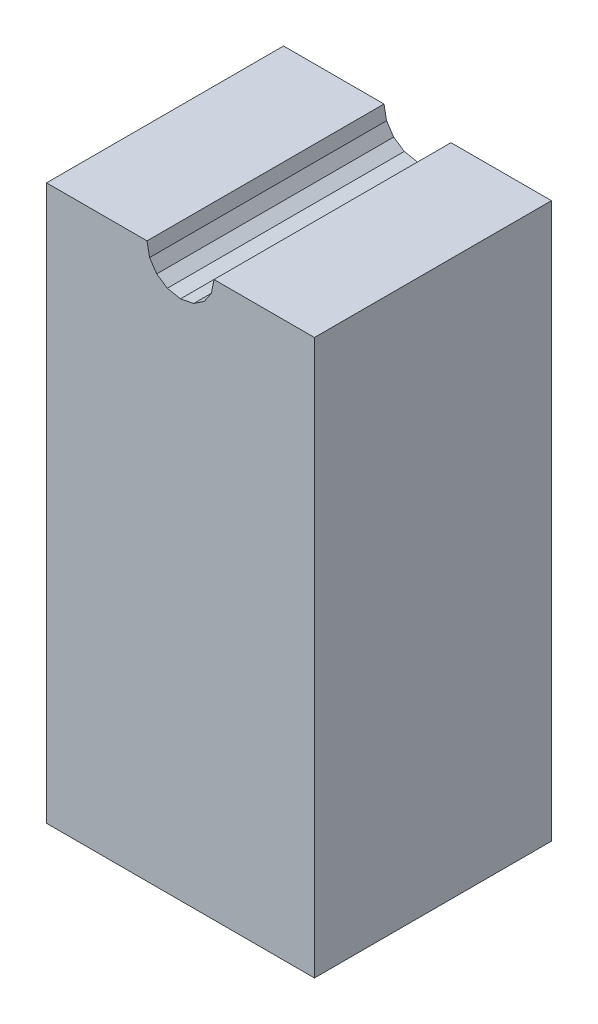
ISO-10303-21;
HEADER;
FILE_DESCRIPTION(('STEP AP214'),'2;1');
FILE_NAME('part.step','',(''),(''),'','','');
FILE_SCHEMA(('AUTOMOTIVE_DESIGN { 1 0 10303 214 1 1 1 1 }'));
ENDSEC;
DATA;
#1=APPLICATION_CONTEXT('core data for automotive mechanical design processes');
#2=APPLICATION_PROTOCOL_DEFINITION('international standard','automotive_design',2000,#1);
#3=PRODUCT_CONTEXT('',#1,'mechanical');
#4=PRODUCT('Part','Part','',(#3));
#5=PRODUCT_RELATED_PRODUCT_CATEGORY('part','',(#4));
#6=PRODUCT_DEFINITION_FORMATION('','',#4);
#7=PRODUCT_DEFINITION_CONTEXT('part definition',#1,'design');
#8=PRODUCT_DEFINITION('design','',#6,#7);
#9=PRODUCT_DEFINITION_SHAPE('','',#8);
#10=(LENGTH_UNIT() NAMED_UNIT(*) SI_UNIT(.MILLI.,.METRE.));
#11=(NAMED_UNIT(*) PLANE_ANGLE_UNIT() SI_UNIT($,.RADIAN.));
#12=(NAMED_UNIT(*) SI_UNIT($,.STERADIAN.) SOLID_ANGLE_UNIT());
#13=UNCERTAINTY_MEASURE_WITH_UNIT(LENGTH_MEASURE(1.E-05),#10,'distance_accuracy_value','');
#14=(GEOMETRIC_REPRESENTATION_CONTEXT(3) GLOBAL_UNCERTAINTY_ASSIGNED_CONTEXT((#13)) GLOBAL_UNIT_ASSIGNED_CONTEXT((#10,
#11,#12)) REPRESENTATION_CONTEXT('',''));
#15=CARTESIAN_POINT('',(0.,0.,0.));
#16=DIRECTION('',(0.,0.,1.));
#17=DIRECTION('',(1.,0.,0.));
#18=AXIS2_PLACEMENT_3D('',#15,#16,#17);
#19=CARTESIAN_POINT('',(0.10621,1.98614,0.25));
#20=DIRECTION('',(0.192365612082986,-0.98132332657893,0.));
#21=DIRECTION('',(0.98132332657893,0.192365612082986,0.));
#22=AXIS2_PLACEMENT_3D('',#19,#20,#21);
#23=PLANE('',#22);
#24=DIRECTION('',(0.,0.,1.));
#25=VECTOR('',#24,1.);
#26=CARTESIAN_POINT('',(0.106209999999987,1.98614000000002,0.25));
#27=LINE('',#26,#25);
#28=CARTESIAN_POINT('',(0.106209999999997,1.98614,2.16));
#29=VERTEX_POINT('',#28);
#30=CARTESIAN_POINT('',(0.106209999999997,1.98614,0.25));
#31=VERTEX_POINT('',#30);
#32=EDGE_CURVE('E121',#29,#31,#27,.F.);
#33=ORIENTED_EDGE('',*,*,#32,.T.);
#34=DIRECTION('',(0.98132332657893,0.192365612082986,0.));
#35=VECTOR('',#34,1.);
#36=CARTESIAN_POINT('',(0.10621,1.98614,0.25));
#37=LINE('',#36,#35);
#38=CARTESIAN_POINT('',(0.,1.96532000000001,0.25));
#39=VERTEX_POINT('',#38);
#40=EDGE_CURVE('E20',#39,#31,#37,.T.);
#41=ORIENTED_EDGE('',*,*,#40,.F.);
#42=DIRECTION('',(0.,0.,1.));
#43=VECTOR('',#42,1.);
#44=CARTESIAN_POINT('',(0.,1.96532,0.25));
#45=LINE('',#44,#43);
#46=CARTESIAN_POINT('',(0.,1.96532000000002,2.16));
#47=VERTEX_POINT('',#46);
#48=EDGE_CURVE('E138',#39,#47,#45,.T.);
#49=ORIENTED_EDGE('',*,*,#48,.T.);
#50=DIRECTION('',(0.98132332657893,0.192365612082986,0.));
#51=VECTOR('',#50,1.);
#52=CARTESIAN_POINT('',(0.10621,1.98614,2.16));
#53=LINE('',#52,#51);
#54=EDGE_CURVE('E108',#29,#47,#53,.F.);
#55=ORIENTED_EDGE('',*,*,#54,.F.);
#56=EDGE_LOOP('',(#33,#41,#49,#55));
#57=FACE_BOUND('',#56,.T.);
#58=ADVANCED_FACE('F17',(#57),#23,.F.);
#59=CARTESIAN_POINT('',(0.19186,2.04333,0.25));
#60=DIRECTION('',(0.55530504654784,-0.831646743081761,0.));
#61=DIRECTION('',(0.831646743081761,0.55530504654784,0.));
#62=AXIS2_PLACEMENT_3D('',#59,#60,#61);
#63=PLANE('',#62);
#64=DIRECTION('',(0.,0.,1.));
#65=VECTOR('',#64,1.);
#66=CARTESIAN_POINT('',(0.191860000000052,2.04332999999997,0.25));
#67=LINE('',#66,#65);
#68=CARTESIAN_POINT('',(0.191860000000013,2.04332999999999,2.16));
#69=VERTEX_POINT('',#68);
#70=CARTESIAN_POINT('',(0.191860000000013,2.04332999999999,0.25));
#71=VERTEX_POINT('',#70);
#72=EDGE_CURVE('E126',#69,#71,#67,.F.);
#73=ORIENTED_EDGE('',*,*,#72,.T.);
#74=DIRECTION('',(0.831646743081761,0.55530504654784,0.));
#75=VECTOR('',#74,1.);
#76=CARTESIAN_POINT('',(0.19186,2.04333,0.25));
#77=LINE('',#76,#75);
#78=EDGE_CURVE('E115',#31,#71,#77,.T.);
#79=ORIENTED_EDGE('',*,*,#78,.F.);
#80=ORIENTED_EDGE('',*,*,#32,.F.);
#81=DIRECTION('',(0.831646743081761,0.55530504654784,0.));
#82=VECTOR('',#81,1.);
#83=CARTESIAN_POINT('',(0.19186,2.04333,2.16));
#84=LINE('',#83,#82);
#85=EDGE_CURVE('E128',#69,#29,#84,.F.);
#86=ORIENTED_EDGE('',*,*,#85,.F.);
#87=EDGE_LOOP('',(#73,#79,#80,#86));
#88=FACE_BOUND('',#87,.T.);
#89=ADVANCED_FACE('F124',(#88),#63,.F.);
#90=CARTESIAN_POINT('',(0.,1.96532,0.25));
#91=DIRECTION('',(-0.192365612082986,-0.98132332657893,0.));
#92=DIRECTION('',(0.98132332657893,-0.192365612082986,0.));
#93=AXIS2_PLACEMENT_3D('',#90,#91,#92);
#94=PLANE('',#93);
#95=ORIENTED_EDGE('',*,*,#48,.F.);
#96=DIRECTION('',(0.98132332657893,-0.192365612082986,0.));
#97=VECTOR('',#96,1.);
#98=CARTESIAN_POINT('',(0.,1.96532,0.25));
#99=LINE('',#98,#97);
#100=CARTESIAN_POINT('',(-0.106210000000002,1.98613999999999,0.25));
#101=VERTEX_POINT('',#100);
#102=EDGE_CURVE('E118',#101,#39,#99,.T.);
#103=ORIENTED_EDGE('',*,*,#102,.F.);
#104=DIRECTION('',(0.,0.,1.));
#105=VECTOR('',#104,1.);
#106=CARTESIAN_POINT('',(-0.10621,1.98614,0.25));
#107=LINE('',#106,#105);
#108=CARTESIAN_POINT('',(-0.106210000000004,1.98613999999998,2.16));
#109=VERTEX_POINT('',#108);
#110=EDGE_CURVE('E143',#101,#109,#107,.T.);
#111=ORIENTED_EDGE('',*,*,#110,.T.);
#112=DIRECTION('',(0.98132332657893,-0.192365612082986,0.));
#113=VECTOR('',#112,1.);
#114=CARTESIAN_POINT('',(0.,1.96532,2.16));
#115=LINE('',#114,#113);
#116=EDGE_CURVE('E136',#47,#109,#115,.F.);
#117=ORIENTED_EDGE('',*,*,#116,.F.);
#118=EDGE_LOOP('',(#95,#103,#111,#117));
#119=FACE_BOUND('',#118,.T.);
#120=ADVANCED_FACE('F141',(#119),#94,.F.);
#121=CARTESIAN_POINT('',(0.24906,2.12899,0.25));
#122=DIRECTION('',(0.831631844675963,-0.555327358339975,0.));
#123=DIRECTION('',(0.555327358339975,0.831631844675963,0.));
#124=AXIS2_PLACEMENT_3D('',#121,#122,#123);
#125=PLANE('',#124);
#126=DIRECTION('',(0.,0.,1.));
#127=VECTOR('',#126,1.);
#128=CARTESIAN_POINT('',(0.249060000000039,2.12898999999999,0.25));
#129=LINE('',#128,#127);
#130=CARTESIAN_POINT('',(0.24906000000001,2.12899,2.16));
#131=VERTEX_POINT('',#130);
#132=CARTESIAN_POINT('',(0.24906000000001,2.12899,0.25));
#133=VERTEX_POINT('',#132);
#134=EDGE_CURVE('E157',#131,#133,#129,.F.);
#135=ORIENTED_EDGE('',*,*,#134,.T.);
#136=DIRECTION('',(0.555327358339975,0.831631844675963,0.));
#137=VECTOR('',#136,1.);
#138=CARTESIAN_POINT('',(0.24906,2.12899,0.25));
#139=LINE('',#138,#137);
#140=EDGE_CURVE('E146',#71,#133,#139,.T.);
#141=ORIENTED_EDGE('',*,*,#140,.F.);
#142=ORIENTED_EDGE('',*,*,#72,.F.);
#143=DIRECTION('',(0.555327358339975,0.831631844675963,0.));
#144=VECTOR('',#143,1.);
#145=CARTESIAN_POINT('',(0.24906,2.12899,2.16));
#146=LINE('',#145,#144);
#147=EDGE_CURVE('E150',#131,#69,#146,.F.);
#148=ORIENTED_EDGE('',*,*,#147,.F.);
#149=EDGE_LOOP('',(#135,#141,#142,#148));
#150=FACE_BOUND('',#149,.T.);
#151=ADVANCED_FACE('F242',(#150),#125,.F.);
#152=CARTESIAN_POINT('',(-0.10621,1.98614,0.25));
#153=DIRECTION('',(-0.55530504654784,-0.831646743081761,0.));
#154=DIRECTION('',(0.831646743081761,-0.55530504654784,0.));
#155=AXIS2_PLACEMENT_3D('',#152,#153,#154);
#156=PLANE('',#155);
#157=ORIENTED_EDGE('',*,*,#110,.F.);
#158=DIRECTION('',(0.831646743081761,-0.55530504654784,0.));
#159=VECTOR('',#158,1.);
#160=CARTESIAN_POINT('',(-0.10621,1.98614,0.25));
#161=LINE('',#160,#159);
#162=CARTESIAN_POINT('',(-0.191860000000003,2.04333,0.25));
#163=VERTEX_POINT('',#162);
#164=EDGE_CURVE('E152',#163,#101,#161,.T.);
#165=ORIENTED_EDGE('',*,*,#164,.F.);
#166=DIRECTION('',(0.,0.,1.));
#167=VECTOR('',#166,1.);
#168=CARTESIAN_POINT('',(-0.19186,2.04333,0.25));
#169=LINE('',#168,#167);
#170=CARTESIAN_POINT('',(-0.191860000000007,2.04332999999999,2.16));
#171=VERTEX_POINT('',#170);
#172=EDGE_CURVE('E167',#163,#171,#169,.T.);
#173=ORIENTED_EDGE('',*,*,#172,.T.);
#174=DIRECTION('',(0.831646743081761,-0.55530504654784,0.));
#175=VECTOR('',#174,1.);
#176=CARTESIAN_POINT('',(-0.10621,1.98614,2.16));
#177=LINE('',#176,#175);
#178=EDGE_CURVE('E155',#109,#171,#177,.F.);
#179=ORIENTED_EDGE('',*,*,#178,.F.);
#180=EDGE_LOOP('',(#157,#165,#173,#179));
#181=FACE_BOUND('',#180,.T.);
#182=ADVANCED_FACE('F239',(#181),#156,.F.);
#183=CARTESIAN_POINT('',(0.26988,2.2352,0.25));
#184=DIRECTION('',(0.98132332657893,-0.192365612082986,0.));
#185=DIRECTION('',(0.192365612082986,0.98132332657893,0.));
#186=AXIS2_PLACEMENT_3D('',#183,#184,#185);
#187=PLANE('',#186);
#188=DIRECTION('',(0.,0.,-1.));
#189=VECTOR('',#188,1.);
#190=CARTESIAN_POINT('',(0.26988,2.2352,0.25));
#191=LINE('',#190,#189);
#192=CARTESIAN_POINT('',(0.26988,2.2352,2.16));
#193=VERTEX_POINT('',#192);
#194=CARTESIAN_POINT('',(0.26988,2.2352,0.25));
#195=VERTEX_POINT('',#194);
#196=EDGE_CURVE('E172',#193,#195,#191,.T.);
#197=ORIENTED_EDGE('',*,*,#196,.T.);
#198=DIRECTION('',(0.192365612082986,0.98132332657893,0.));
#199=VECTOR('',#198,1.);
#200=CARTESIAN_POINT('',(0.26988,2.2352,0.25));
#201=LINE('',#200,#199);
#202=EDGE_CURVE('E160',#133,#195,#201,.T.);
#203=ORIENTED_EDGE('',*,*,#202,.F.);
#204=ORIENTED_EDGE('',*,*,#134,.F.);
#205=DIRECTION('',(0.192365612082986,0.98132332657893,0.));
#206=VECTOR('',#205,1.);
#207=CARTESIAN_POINT('',(0.26988,2.2352,2.16));
#208=LINE('',#207,#206);
#209=EDGE_CURVE('E162',#193,#131,#208,.F.);
#210=ORIENTED_EDGE('',*,*,#209,.F.);
#211=EDGE_LOOP('',(#197,#203,#204,#210));
#212=FACE_BOUND('',#211,.T.);
#213=ADVANCED_FACE('F241',(#212),#187,.F.);
#214=CARTESIAN_POINT('',(-0.19186,2.04333,0.25));
#215=DIRECTION('',(-0.831631844675963,-0.555327358339975,0.));
#216=DIRECTION('',(0.555327358339975,-0.831631844675963,0.));
#217=AXIS2_PLACEMENT_3D('',#214,#215,#216);
#218=PLANE('',#217);
#219=ORIENTED_EDGE('',*,*,#172,.F.);
#220=DIRECTION('',(0.555327358339975,-0.831631844675963,0.));
#221=VECTOR('',#220,1.);
#222=CARTESIAN_POINT('',(-0.19186,2.04333,0.25));
#223=LINE('',#222,#221);
#224=CARTESIAN_POINT('',(-0.249059999999987,2.12899000000001,0.25));
#225=VERTEX_POINT('',#224);
#226=EDGE_CURVE('E165',#225,#163,#223,.T.);
#227=ORIENTED_EDGE('',*,*,#226,.F.);
#228=DIRECTION('',(0.,0.,1.));
#229=VECTOR('',#228,1.);
#230=CARTESIAN_POINT('',(-0.24906,2.12899,0.25));
#231=LINE('',#230,#229);
#232=CARTESIAN_POINT('',(-0.249059999999974,2.12899000000002,2.16));
#233=VERTEX_POINT('',#232);
#234=EDGE_CURVE('E183',#225,#233,#231,.T.);
#235=ORIENTED_EDGE('',*,*,#234,.T.);
#236=DIRECTION('',(0.555327358339975,-0.831631844675963,0.));
#237=VECTOR('',#236,1.);
#238=CARTESIAN_POINT('',(-0.19186,2.04333,2.16));
#239=LINE('',#238,#237);
#240=EDGE_CURVE('E170',#171,#233,#239,.F.);
#241=ORIENTED_EDGE('',*,*,#240,.F.);
#242=EDGE_LOOP('',(#219,#227,#235,#241));
#243=FACE_BOUND('',#242,.T.);
#244=ADVANCED_FACE('F237',(#243),#218,.F.);
#245=CARTESIAN_POINT('',(1.0795,2.2352,0.25));
#246=DIRECTION('',(0.,-1.,0.));
#247=DIRECTION('',(0.,0.,-1.));
#248=AXIS2_PLACEMENT_3D('',#245,#246,#247);
#249=PLANE('',#248);
#250=DIRECTION('',(0.,0.,1.));
#251=VECTOR('',#250,1.);
#252=CARTESIAN_POINT('',(1.0795,2.2352,0.25));
#253=LINE('',#252,#251);
#254=CARTESIAN_POINT('',(1.0795,2.2352,2.16));
#255=VERTEX_POINT('',#254);
#256=CARTESIAN_POINT('',(1.0795,2.2352,0.25));
#257=VERTEX_POINT('',#256);
#258=EDGE_CURVE('E188',#255,#257,#253,.F.);
#259=ORIENTED_EDGE('',*,*,#258,.T.);
#260=DIRECTION('',(1.,0.,0.));
#261=VECTOR('',#260,1.);
#262=CARTESIAN_POINT('',(1.0795,2.2352,0.25));
#263=LINE('',#262,#261);
#264=EDGE_CURVE('E175',#195,#257,#263,.T.);
#265=ORIENTED_EDGE('',*,*,#264,.F.);
#266=ORIENTED_EDGE('',*,*,#196,.F.);
#267=DIRECTION('',(1.,0.,0.));
#268=VECTOR('',#267,1.);
#269=CARTESIAN_POINT('',(1.0795,2.2352,2.16));
#270=LINE('',#269,#268);
#271=EDGE_CURVE('E178',#255,#193,#270,.F.);
#272=ORIENTED_EDGE('',*,*,#271,.F.);
#273=EDGE_LOOP('',(#259,#265,#266,#272));
#274=FACE_BOUND('',#273,.T.);
#275=ADVANCED_FACE('F272',(#274),#249,.F.);
#276=CARTESIAN_POINT('',(-0.24906,2.12899,0.25));
#277=DIRECTION('',(-0.98132332657893,-0.192365612082986,0.));
#278=DIRECTION('',(0.192365612082986,-0.98132332657893,0.));
#279=AXIS2_PLACEMENT_3D('',#276,#277,#278);
#280=PLANE('',#279);
#281=ORIENTED_EDGE('',*,*,#234,.F.);
#282=DIRECTION('',(0.192365612082986,-0.98132332657893,0.));
#283=VECTOR('',#282,1.);
#284=CARTESIAN_POINT('',(-0.24906,2.12899,0.25));
#285=LINE('',#284,#283);
#286=CARTESIAN_POINT('',(-0.26987999999999,2.2352,0.25));
#287=VERTEX_POINT('',#286);
#288=EDGE_CURVE('E181',#287,#225,#285,.T.);
#289=ORIENTED_EDGE('',*,*,#288,.F.);
#290=DIRECTION('',(0.,0.,-1.));
#291=VECTOR('',#290,1.);
#292=CARTESIAN_POINT('',(-0.26988,2.2352,0.25));
#293=LINE('',#292,#291);
#294=CARTESIAN_POINT('',(-0.269879999999981,2.2352,2.16));
#295=VERTEX_POINT('',#294);
#296=EDGE_CURVE('E192',#287,#295,#293,.F.);
#297=ORIENTED_EDGE('',*,*,#296,.T.);
#298=DIRECTION('',(0.192365612082986,-0.98132332657893,0.));
#299=VECTOR('',#298,1.);
#300=CARTESIAN_POINT('',(-0.24906,2.12899,2.16));
#301=LINE('',#300,#299);
#302=EDGE_CURVE('E186',#233,#295,#301,.F.);
#303=ORIENTED_EDGE('',*,*,#302,.F.);
#304=EDGE_LOOP('',(#281,#289,#297,#303));
#305=FACE_BOUND('',#304,.T.);
#306=ADVANCED_FACE('F232',(#305),#280,.F.);
#307=CARTESIAN_POINT('',(-0.26988,2.2352,0.25));
#308=DIRECTION('',(0.,-1.,0.));
#309=DIRECTION('',(0.,0.,-1.));
#310=AXIS2_PLACEMENT_3D('',#307,#308,#309);
#311=PLANE('',#310);
#312=ORIENTED_EDGE('',*,*,#296,.F.);
#313=DIRECTION('',(1.,0.,0.));
#314=VECTOR('',#313,1.);
#315=CARTESIAN_POINT('',(-0.26988,2.2352,0.25));
#316=LINE('',#315,#314);
#317=CARTESIAN_POINT('',(-1.0795,2.2352,0.25));
#318=VERTEX_POINT('',#317);
#319=EDGE_CURVE('E35',#318,#287,#316,.T.);
#320=ORIENTED_EDGE('',*,*,#319,.F.);
#321=DIRECTION('',(0.,0.,-1.));
#322=VECTOR('',#321,1.);
#323=CARTESIAN_POINT('',(-1.0795,2.2352,0.25));
#324=LINE('',#323,#322);
#325=CARTESIAN_POINT('',(-1.0795,2.2352,2.16));
#326=VERTEX_POINT('',#325);
#327=EDGE_CURVE('E207',#318,#326,#324,.F.);
#328=ORIENTED_EDGE('',*,*,#327,.T.);
#329=DIRECTION('',(-1.,0.,0.));
#330=VECTOR('',#329,1.);
#331=CARTESIAN_POINT('',(1.0795,2.2352,2.16));
#332=LINE('',#331,#330);
#333=EDGE_CURVE('E195',#326,#295,#332,.F.);
#334=ORIENTED_EDGE('',*,*,#333,.T.);
#335=EDGE_LOOP('',(#312,#320,#328,#334));
#336=FACE_BOUND('',#335,.T.);
#337=ADVANCED_FACE('F226',(#336),#311,.F.);
#338=CARTESIAN_POINT('',(1.0795,2.2352,2.16));
#339=DIRECTION('',(0.,0.,-1.));
#340=DIRECTION('',(-1.,0.,0.));
#341=AXIS2_PLACEMENT_3D('',#338,#339,#340);
#342=PLANE('',#341);
#343=ORIENTED_EDGE('',*,*,#147,.T.);
#344=ORIENTED_EDGE('',*,*,#85,.T.);
#345=ORIENTED_EDGE('',*,*,#54,.T.);
#346=ORIENTED_EDGE('',*,*,#116,.T.);
#347=ORIENTED_EDGE('',*,*,#178,.T.);
#348=ORIENTED_EDGE('',*,*,#240,.T.);
#349=ORIENTED_EDGE('',*,*,#302,.T.);
#350=ORIENTED_EDGE('',*,*,#333,.F.);
#351=DIRECTION('',(0.,1.,0.));
#352=VECTOR('',#351,1.);
#353=CARTESIAN_POINT('',(-1.0795,2.2352,2.16));
#354=LINE('',#353,#352);
#355=CARTESIAN_POINT('',(-1.0795,-2.2352,2.16));
#356=VERTEX_POINT('',#355);
#357=EDGE_CURVE('E209',#326,#356,#354,.F.);
#358=ORIENTED_EDGE('',*,*,#357,.T.);
#359=DIRECTION('',(1.,0.,0.));
#360=VECTOR('',#359,1.);
#361=CARTESIAN_POINT('',(-1.0795,-2.2352,2.16));
#362=LINE('',#361,#360);
#363=CARTESIAN_POINT('',(1.0795,-2.2352,2.16));
#364=VERTEX_POINT('',#363);
#365=EDGE_CURVE('E202',#356,#364,#362,.T.);
#366=ORIENTED_EDGE('',*,*,#365,.T.);
#367=DIRECTION('',(0.,1.,0.));
#368=VECTOR('',#367,1.);
#369=CARTESIAN_POINT('',(1.0795,-2.2352,2.16));
#370=LINE('',#369,#368);
#371=EDGE_CURVE('E198',#364,#255,#370,.T.);
#372=ORIENTED_EDGE('',*,*,#371,.T.);
#373=ORIENTED_EDGE('',*,*,#271,.T.);
#374=ORIENTED_EDGE('',*,*,#209,.T.);
#375=EDGE_LOOP('',(#343,#344,#345,#346,#347,#348,#349,#350,#358,#366,#372,#373,#374));
#376=FACE_BOUND('',#375,.T.);
#377=ADVANCED_FACE('F134',(#376),#342,.F.);
#378=CARTESIAN_POINT('',(1.0795,-2.2352,0.25));
#379=DIRECTION('',(-1.,0.,0.));
#380=DIRECTION('',(0.,0.,1.));
#381=AXIS2_PLACEMENT_3D('',#378,#379,#380);
#382=PLANE('',#381);
#383=DIRECTION('',(0.,0.,1.));
#384=VECTOR('',#383,1.);
#385=CARTESIAN_POINT('',(1.0795,-2.2352,0.25));
#386=LINE('',#385,#384);
#387=CARTESIAN_POINT('',(1.0795,-2.2352,0.25));
#388=VERTEX_POINT('',#387);
#389=EDGE_CURVE('E200',#364,#388,#386,.F.);
#390=ORIENTED_EDGE('',*,*,#389,.T.);
#391=DIRECTION('',(0.,1.,0.));
#392=VECTOR('',#391,1.);
#393=CARTESIAN_POINT('',(1.0795,2.2352,0.25));
#394=LINE('',#393,#392);
#395=EDGE_CURVE('E212',#257,#388,#394,.F.);
#396=ORIENTED_EDGE('',*,*,#395,.F.);
#397=ORIENTED_EDGE('',*,*,#258,.F.);
#398=ORIENTED_EDGE('',*,*,#371,.F.);
#399=EDGE_LOOP('',(#390,#396,#397,#398));
#400=FACE_BOUND('',#399,.T.);
#401=ADVANCED_FACE('F262',(#400),#382,.F.);
#402=CARTESIAN_POINT('',(-1.0795,-2.2352,0.25));
#403=DIRECTION('',(0.,1.,0.));
#404=DIRECTION('',(0.,0.,1.));
#405=AXIS2_PLACEMENT_3D('',#402,#403,#404);
#406=PLANE('',#405);
#407=DIRECTION('',(0.,0.,-1.));
#408=VECTOR('',#407,1.);
#409=CARTESIAN_POINT('',(-1.0795,-2.2352,0.25));
#410=LINE('',#409,#408);
#411=CARTESIAN_POINT('',(-1.0795,-2.2352,0.25));
#412=VERTEX_POINT('',#411);
#413=EDGE_CURVE('E205',#356,#412,#410,.T.);
#414=ORIENTED_EDGE('',*,*,#413,.T.);
#415=DIRECTION('',(-1.,0.,0.));
#416=VECTOR('',#415,1.);
#417=CARTESIAN_POINT('',(1.0795,-2.2352,0.25));
#418=LINE('',#417,#416);
#419=EDGE_CURVE('E26',#388,#412,#418,.T.);
#420=ORIENTED_EDGE('',*,*,#419,.F.);
#421=ORIENTED_EDGE('',*,*,#389,.F.);
#422=ORIENTED_EDGE('',*,*,#365,.F.);
#423=EDGE_LOOP('',(#414,#420,#421,#422));
#424=FACE_BOUND('',#423,.T.);
#425=ADVANCED_FACE('F220',(#424),#406,.F.);
#426=CARTESIAN_POINT('',(-1.0795,2.2352,0.25));
#427=DIRECTION('',(1.,0.,0.));
#428=DIRECTION('',(0.,0.,-1.));
#429=AXIS2_PLACEMENT_3D('',#426,#427,#428);
#430=PLANE('',#429);
#431=ORIENTED_EDGE('',*,*,#327,.F.);
#432=DIRECTION('',(0.,1.,0.));
#433=VECTOR('',#432,1.);
#434=CARTESIAN_POINT('',(-1.0795,2.2352,0.25));
#435=LINE('',#434,#433);
#436=EDGE_CURVE('E11',#412,#318,#435,.T.);
#437=ORIENTED_EDGE('',*,*,#436,.F.);
#438=ORIENTED_EDGE('',*,*,#413,.F.);
#439=ORIENTED_EDGE('',*,*,#357,.F.);
#440=EDGE_LOOP('',(#431,#437,#438,#439));
#441=FACE_BOUND('',#440,.T.);
#442=ADVANCED_FACE('F224',(#441),#430,.F.);
#443=CARTESIAN_POINT('',(1.0795,2.2352,0.25));
#444=DIRECTION('',(0.,0.,-1.));
#445=DIRECTION('',(-1.,0.,0.));
#446=AXIS2_PLACEMENT_3D('',#443,#444,#445);
#447=PLANE('',#446);
#448=ORIENTED_EDGE('',*,*,#140,.T.);
#449=ORIENTED_EDGE('',*,*,#202,.T.);
#450=ORIENTED_EDGE('',*,*,#264,.T.);
#451=ORIENTED_EDGE('',*,*,#395,.T.);
#452=ORIENTED_EDGE('',*,*,#419,.T.);
#453=ORIENTED_EDGE('',*,*,#436,.T.);
#454=ORIENTED_EDGE('',*,*,#319,.T.);
#455=ORIENTED_EDGE('',*,*,#288,.T.);
#456=ORIENTED_EDGE('',*,*,#226,.T.);
#457=ORIENTED_EDGE('',*,*,#164,.T.);
#458=ORIENTED_EDGE('',*,*,#102,.T.);
#459=ORIENTED_EDGE('',*,*,#40,.T.);
#460=ORIENTED_EDGE('',*,*,#78,.T.);
#461=EDGE_LOOP('',(#448,#449,#450,#451,#452,#453,#454,#455,#456,#457,#458,#459,#460));
#462=FACE_BOUND('',#461,.T.);
#463=ADVANCED_FACE('F113',(#462),#447,.T.);
#464=CLOSED_SHELL('',(#58,#89,#120,#151,#182,#213,#244,#275,#306,#337,#377,#401,#425,#442,#463));
#465=MANIFOLD_SOLID_BREP('B1',#464);
#466=ADVANCED_BREP_SHAPE_REPRESENTATION('',(#18,#465),#14);
#467=SHAPE_DEFINITION_REPRESENTATION(#9,#466);
ENDSEC;
END-ISO-10303-21;
